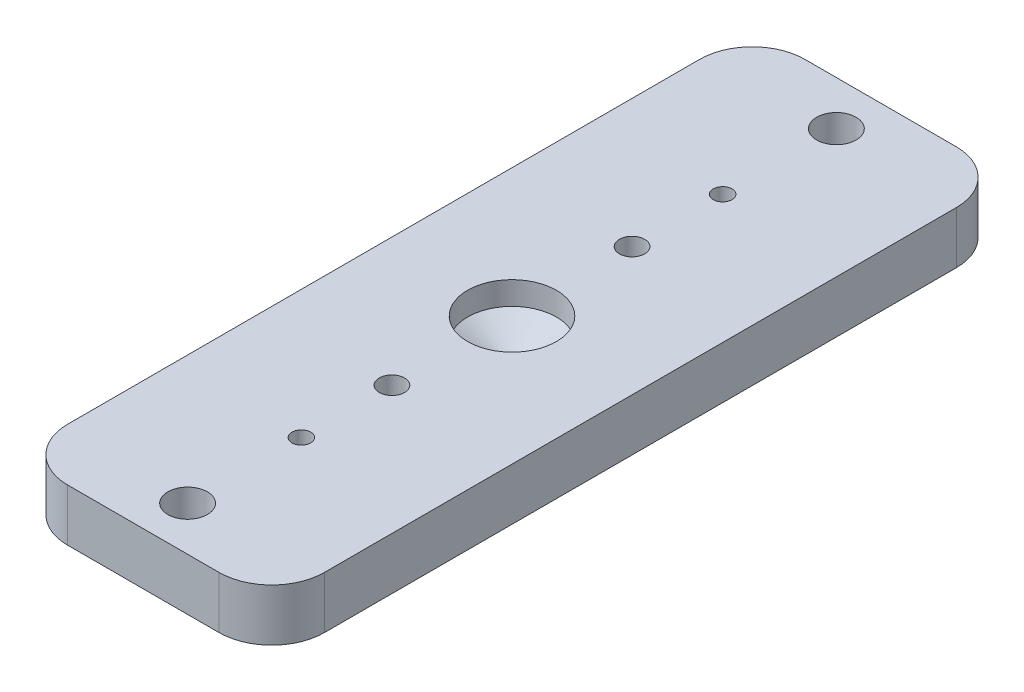
ISO-10303-21;
HEADER;
FILE_DESCRIPTION(('STEP AP214'),'2;1');
FILE_NAME('part.step','',(''),(''),'','','');
FILE_SCHEMA(('AUTOMOTIVE_DESIGN { 1 0 10303 214 1 1 1 1 }'));
ENDSEC;
DATA;
#1=APPLICATION_CONTEXT('core data for automotive mechanical design processes');
#2=APPLICATION_PROTOCOL_DEFINITION('international standard','automotive_design',2000,#1);
#3=PRODUCT_CONTEXT('',#1,'mechanical');
#4=PRODUCT('Part','Part','',(#3));
#5=PRODUCT_RELATED_PRODUCT_CATEGORY('part','',(#4));
#6=PRODUCT_DEFINITION_FORMATION('','',#4);
#7=PRODUCT_DEFINITION_CONTEXT('part definition',#1,'design');
#8=PRODUCT_DEFINITION('design','',#6,#7);
#9=PRODUCT_DEFINITION_SHAPE('','',#8);
#10=(LENGTH_UNIT() NAMED_UNIT(*) SI_UNIT(.MILLI.,.METRE.));
#11=(NAMED_UNIT(*) PLANE_ANGLE_UNIT() SI_UNIT($,.RADIAN.));
#12=(NAMED_UNIT(*) SI_UNIT($,.STERADIAN.) SOLID_ANGLE_UNIT());
#13=UNCERTAINTY_MEASURE_WITH_UNIT(LENGTH_MEASURE(1.E-05),#10,'distance_accuracy_value','');
#14=(GEOMETRIC_REPRESENTATION_CONTEXT(3) GLOBAL_UNCERTAINTY_ASSIGNED_CONTEXT((#13)) GLOBAL_UNIT_ASSIGNED_CONTEXT((#10,
#11,#12)) REPRESENTATION_CONTEXT('',''));
#15=CARTESIAN_POINT('',(0.,0.,0.));
#16=DIRECTION('',(0.,0.,1.));
#17=DIRECTION('',(1.,0.,0.));
#18=AXIS2_PLACEMENT_3D('',#15,#16,#17);
#19=CARTESIAN_POINT('',(0.,4.7625,-14.478));
#20=DIRECTION('',(0.,-1.,0.));
#21=DIRECTION('',(0.,0.,-1.));
#22=AXIS2_PLACEMENT_3D('',#19,#20,#21);
#23=CYLINDRICAL_SURFACE('',#22,1.524);
#24=CARTESIAN_POINT('',(0.,4.7625,-14.478));
#25=DIRECTION('',(0.,-1.,0.));
#26=DIRECTION('',(0.,0.,1.));
#27=AXIS2_PLACEMENT_3D('',#24,#25,#26);
#28=CIRCLE('',#27,1.524);
#29=CARTESIAN_POINT('',(0.,4.7625,-12.954));
#30=VERTEX_POINT('',#29);
#31=EDGE_CURVE('E178',#30,#30,#28,.T.);
#32=ORIENTED_EDGE('',*,*,#31,.F.);
#33=EDGE_LOOP('',(#32));
#34=FACE_BOUND('',#33,.T.);
#35=CARTESIAN_POINT('',(0.,1.778,-14.478));
#36=DIRECTION('',(0.,-1.,0.));
#37=DIRECTION('',(0.,0.,-1.));
#38=AXIS2_PLACEMENT_3D('',#35,#36,#37);
#39=CIRCLE('',#38,1.524);
#40=CARTESIAN_POINT('',(0.,1.778,-16.002));
#41=VERTEX_POINT('',#40);
#42=EDGE_CURVE('E126',#41,#41,#39,.F.);
#43=ORIENTED_EDGE('',*,*,#42,.F.);
#44=EDGE_LOOP('',(#43));
#45=FACE_BOUND('',#44,.T.);
#46=ADVANCED_FACE('F35',(#34,#45),#23,.F.);
#47=CARTESIAN_POINT('',(-15.478125,4.7625,-44.45));
#48=DIRECTION('',(0.,0.,1.));
#49=DIRECTION('',(1.,0.,0.));
#50=AXIS2_PLACEMENT_3D('',#47,#48,#49);
#51=PLANE('',#50);
#52=DIRECTION('',(-1.,0.,0.));
#53=VECTOR('',#52,1.);
#54=CARTESIAN_POINT('',(-15.478125,4.7625,-44.45));
#55=LINE('',#54,#53);
#56=CARTESIAN_POINT('',(9.128125,4.7625,-44.45));
#57=VERTEX_POINT('',#56);
#58=CARTESIAN_POINT('',(-9.128125,4.7625,-44.45));
#59=VERTEX_POINT('',#58);
#60=EDGE_CURVE('E184',#57,#59,#55,.T.);
#61=ORIENTED_EDGE('',*,*,#60,.F.);
#62=DIRECTION('',(0.,-1.,0.));
#63=VECTOR('',#62,1.);
#64=CARTESIAN_POINT('',(9.128125,4.7625,-44.45));
#65=LINE('',#64,#63);
#66=CARTESIAN_POINT('',(9.128125,-1.524,-44.45));
#67=VERTEX_POINT('',#66);
#68=EDGE_CURVE('E196',#57,#67,#65,.T.);
#69=ORIENTED_EDGE('',*,*,#68,.T.);
#70=DIRECTION('',(1.,0.,0.));
#71=VECTOR('',#70,1.);
#72=CARTESIAN_POINT('',(9.128125,-1.524,-44.45));
#73=LINE('',#72,#71);
#74=CARTESIAN_POINT('',(-9.128125,-1.524,-44.45));
#75=VERTEX_POINT('',#74);
#76=EDGE_CURVE('E163',#75,#67,#73,.T.);
#77=ORIENTED_EDGE('',*,*,#76,.F.);
#78=DIRECTION('',(0.,-1.,0.));
#79=VECTOR('',#78,1.);
#80=CARTESIAN_POINT('',(-9.128125,4.7625,-44.45));
#81=LINE('',#80,#79);
#82=EDGE_CURVE('E194',#75,#59,#81,.F.);
#83=ORIENTED_EDGE('',*,*,#82,.T.);
#84=EDGE_LOOP('',(#61,#69,#77,#83));
#85=FACE_BOUND('',#84,.T.);
#86=ADVANCED_FACE('F219',(#85),#51,.F.);
#87=CARTESIAN_POINT('',(-15.478125,4.7625,44.45));
#88=DIRECTION('',(1.,0.,0.));
#89=DIRECTION('',(0.,0.,-1.));
#90=AXIS2_PLACEMENT_3D('',#87,#88,#89);
#91=PLANE('',#90);
#92=DIRECTION('',(0.,0.,1.));
#93=VECTOR('',#92,1.);
#94=CARTESIAN_POINT('',(-15.478125,4.7625,44.45));
#95=LINE('',#94,#93);
#96=CARTESIAN_POINT('',(-15.478125,4.7625,-38.1));
#97=VERTEX_POINT('',#96);
#98=CARTESIAN_POINT('',(-15.478125,4.7625,38.1));
#99=VERTEX_POINT('',#98);
#100=EDGE_CURVE('E187',#97,#99,#95,.T.);
#101=ORIENTED_EDGE('',*,*,#100,.F.);
#102=DIRECTION('',(0.,-1.,0.));
#103=VECTOR('',#102,1.);
#104=CARTESIAN_POINT('',(-15.478125,4.7625,-38.1));
#105=LINE('',#104,#103);
#106=CARTESIAN_POINT('',(-15.478125,-1.524,-38.1));
#107=VERTEX_POINT('',#106);
#108=EDGE_CURVE('E211',#97,#107,#105,.T.);
#109=ORIENTED_EDGE('',*,*,#108,.T.);
#110=DIRECTION('',(0.,0.,-1.));
#111=VECTOR('',#110,1.);
#112=CARTESIAN_POINT('',(-15.478125,-1.524,-38.1));
#113=LINE('',#112,#111);
#114=CARTESIAN_POINT('',(-15.478125,-1.524,38.1));
#115=VERTEX_POINT('',#114);
#116=EDGE_CURVE('E157',#115,#107,#113,.T.);
#117=ORIENTED_EDGE('',*,*,#116,.F.);
#118=DIRECTION('',(0.,-1.,0.));
#119=VECTOR('',#118,1.);
#120=CARTESIAN_POINT('',(-15.478125,4.7625,38.1));
#121=LINE('',#120,#119);
#122=EDGE_CURVE('E209',#115,#99,#121,.F.);
#123=ORIENTED_EDGE('',*,*,#122,.T.);
#124=EDGE_LOOP('',(#101,#109,#117,#123));
#125=FACE_BOUND('',#124,.T.);
#126=ADVANCED_FACE('F225',(#125),#91,.F.);
#127=CARTESIAN_POINT('',(-15.478125,4.7625,44.45));
#128=DIRECTION('',(0.,0.,-1.));
#129=DIRECTION('',(-1.,0.,0.));
#130=AXIS2_PLACEMENT_3D('',#127,#128,#129);
#131=PLANE('',#130);
#132=DIRECTION('',(0.,-1.,0.));
#133=VECTOR('',#132,1.);
#134=CARTESIAN_POINT('',(-9.128125,4.7625,44.45));
#135=LINE('',#134,#133);
#136=CARTESIAN_POINT('',(-9.128125,4.7625,44.45));
#137=VERTEX_POINT('',#136);
#138=CARTESIAN_POINT('',(-9.128125,-1.524,44.45));
#139=VERTEX_POINT('',#138);
#140=EDGE_CURVE('E44',#137,#139,#135,.T.);
#141=ORIENTED_EDGE('',*,*,#140,.T.);
#142=DIRECTION('',(-1.,0.,0.));
#143=VECTOR('',#142,1.);
#144=CARTESIAN_POINT('',(-9.128125,-1.524,44.45));
#145=LINE('',#144,#143);
#146=CARTESIAN_POINT('',(9.128125,-1.524,44.45));
#147=VERTEX_POINT('',#146);
#148=EDGE_CURVE('E151',#147,#139,#145,.T.);
#149=ORIENTED_EDGE('',*,*,#148,.F.);
#150=DIRECTION('',(0.,-1.,0.));
#151=VECTOR('',#150,1.);
#152=CARTESIAN_POINT('',(9.128125,4.7625,44.45));
#153=LINE('',#152,#151);
#154=CARTESIAN_POINT('',(9.128125,4.7625,44.45));
#155=VERTEX_POINT('',#154);
#156=EDGE_CURVE('E11',#147,#155,#153,.F.);
#157=ORIENTED_EDGE('',*,*,#156,.T.);
#158=DIRECTION('',(1.,0.,0.));
#159=VECTOR('',#158,1.);
#160=CARTESIAN_POINT('',(-15.478125,4.7625,44.45));
#161=LINE('',#160,#159);
#162=EDGE_CURVE('E189',#137,#155,#161,.T.);
#163=ORIENTED_EDGE('',*,*,#162,.F.);
#164=EDGE_LOOP('',(#141,#149,#157,#163));
#165=FACE_BOUND('',#164,.T.);
#166=ADVANCED_FACE('F245',(#165),#131,.F.);
#167=CARTESIAN_POINT('',(15.478125,4.7625,-44.45));
#168=DIRECTION('',(-1.,0.,0.));
#169=DIRECTION('',(0.,0.,1.));
#170=AXIS2_PLACEMENT_3D('',#167,#168,#169);
#171=PLANE('',#170);
#172=DIRECTION('',(0.,-1.,0.));
#173=VECTOR('',#172,1.);
#174=CARTESIAN_POINT('',(15.478125,4.7625,38.1));
#175=LINE('',#174,#173);
#176=CARTESIAN_POINT('',(15.478125,4.7625,38.1));
#177=VERTEX_POINT('',#176);
#178=CARTESIAN_POINT('',(15.478125,-1.524,38.1));
#179=VERTEX_POINT('',#178);
#180=EDGE_CURVE('E198',#177,#179,#175,.T.);
#181=ORIENTED_EDGE('',*,*,#180,.T.);
#182=DIRECTION('',(0.,0.,1.));
#183=VECTOR('',#182,1.);
#184=CARTESIAN_POINT('',(15.478125,-1.524,38.1));
#185=LINE('',#184,#183);
#186=CARTESIAN_POINT('',(15.478125,-1.524,-38.1));
#187=VERTEX_POINT('',#186);
#188=EDGE_CURVE('E145',#187,#179,#185,.T.);
#189=ORIENTED_EDGE('',*,*,#188,.F.);
#190=DIRECTION('',(0.,-1.,0.));
#191=VECTOR('',#190,1.);
#192=CARTESIAN_POINT('',(15.478125,4.7625,-38.1));
#193=LINE('',#192,#191);
#194=CARTESIAN_POINT('',(15.478125,4.7625,-38.1));
#195=VERTEX_POINT('',#194);
#196=EDGE_CURVE('E200',#187,#195,#193,.F.);
#197=ORIENTED_EDGE('',*,*,#196,.T.);
#198=DIRECTION('',(0.,0.,-1.));
#199=VECTOR('',#198,1.);
#200=CARTESIAN_POINT('',(15.478125,4.7625,-44.45));
#201=LINE('',#200,#199);
#202=EDGE_CURVE('E191',#177,#195,#201,.T.);
#203=ORIENTED_EDGE('',*,*,#202,.F.);
#204=EDGE_LOOP('',(#181,#189,#197,#203));
#205=FACE_BOUND('',#204,.T.);
#206=ADVANCED_FACE('F241',(#205),#171,.F.);
#207=CARTESIAN_POINT('',(15.478125,4.7625,-44.45));
#208=DIRECTION('',(0.,-1.,0.));
#209=DIRECTION('',(0.,0.,-1.));
#210=AXIS2_PLACEMENT_3D('',#207,#208,#209);
#211=PLANE('',#210);
#212=CARTESIAN_POINT('',(0.,4.7625,0.));
#213=DIRECTION('',(0.,1.,0.));
#214=DIRECTION('',(0.,0.,1.));
#215=AXIS2_PLACEMENT_3D('',#212,#213,#214);
#216=CIRCLE('',#215,5.35812999999999);
#217=CARTESIAN_POINT('',(0.,4.7625,5.35812999999999));
#218=VERTEX_POINT('',#217);
#219=EDGE_CURVE('E113',#218,#218,#216,.T.);
#220=ORIENTED_EDGE('',*,*,#219,.F.);
#221=EDGE_LOOP('',(#220));
#222=FACE_BOUND('',#221,.T.);
#223=CARTESIAN_POINT('',(0.,4.7625,25.4));
#224=DIRECTION('',(0.,1.,0.));
#225=DIRECTION('',(0.,0.,1.));
#226=AXIS2_PLACEMENT_3D('',#223,#224,#225);
#227=CIRCLE('',#226,1.1303);
#228=CARTESIAN_POINT('',(0.,4.7625,26.5303));
#229=VERTEX_POINT('',#228);
#230=EDGE_CURVE('E130',#229,#229,#227,.T.);
#231=ORIENTED_EDGE('',*,*,#230,.F.);
#232=EDGE_LOOP('',(#231));
#233=FACE_BOUND('',#232,.T.);
#234=CARTESIAN_POINT('',(0.,4.7625,-25.4));
#235=DIRECTION('',(0.,1.,0.));
#236=DIRECTION('',(0.,0.,1.));
#237=AXIS2_PLACEMENT_3D('',#234,#235,#236);
#238=CIRCLE('',#237,1.1303);
#239=CARTESIAN_POINT('',(0.,4.7625,-24.2697));
#240=VERTEX_POINT('',#239);
#241=EDGE_CURVE('E136',#240,#240,#238,.T.);
#242=ORIENTED_EDGE('',*,*,#241,.F.);
#243=EDGE_LOOP('',(#242));
#244=FACE_BOUND('',#243,.T.);
#245=CARTESIAN_POINT('',(0.,4.7625,39.116));
#246=DIRECTION('',(0.,-1.,0.));
#247=DIRECTION('',(0.,0.,1.));
#248=AXIS2_PLACEMENT_3D('',#245,#246,#247);
#249=CIRCLE('',#248,2.38125);
#250=CARTESIAN_POINT('',(0.,4.7625,41.49725));
#251=VERTEX_POINT('',#250);
#252=EDGE_CURVE('E172',#251,#251,#249,.T.);
#253=ORIENTED_EDGE('',*,*,#252,.T.);
#254=EDGE_LOOP('',(#253));
#255=FACE_BOUND('',#254,.T.);
#256=CARTESIAN_POINT('',(0.,4.7625,-39.116));
#257=DIRECTION('',(0.,-1.,0.));
#258=DIRECTION('',(0.,0.,-1.));
#259=AXIS2_PLACEMENT_3D('',#256,#257,#258);
#260=CIRCLE('',#259,2.38125);
#261=CARTESIAN_POINT('',(0.,4.7625,-41.49725));
#262=VERTEX_POINT('',#261);
#263=EDGE_CURVE('E175',#262,#262,#260,.T.);
#264=ORIENTED_EDGE('',*,*,#263,.T.);
#265=EDGE_LOOP('',(#264));
#266=FACE_BOUND('',#265,.T.);
#267=ORIENTED_EDGE('',*,*,#31,.T.);
#268=EDGE_LOOP('',(#267));
#269=FACE_BOUND('',#268,.T.);
#270=CARTESIAN_POINT('',(0.,4.7625,14.478));
#271=DIRECTION('',(0.,-1.,0.));
#272=DIRECTION('',(0.,0.,-1.));
#273=AXIS2_PLACEMENT_3D('',#270,#271,#272);
#274=CIRCLE('',#273,1.524);
#275=CARTESIAN_POINT('',(0.,4.7625,12.954));
#276=VERTEX_POINT('',#275);
#277=EDGE_CURVE('E181',#276,#276,#274,.T.);
#278=ORIENTED_EDGE('',*,*,#277,.T.);
#279=EDGE_LOOP('',(#278));
#280=FACE_BOUND('',#279,.T.);
#281=ORIENTED_EDGE('',*,*,#202,.T.);
#282=CARTESIAN_POINT('',(9.128125,4.7625,-38.1));
#283=DIRECTION('',(0.,-1.,0.));
#284=DIRECTION('',(0.,0.,-1.));
#285=AXIS2_PLACEMENT_3D('',#282,#283,#284);
#286=CIRCLE('',#285,6.35);
#287=EDGE_CURVE('E207',#195,#57,#286,.F.);
#288=ORIENTED_EDGE('',*,*,#287,.T.);
#289=ORIENTED_EDGE('',*,*,#60,.T.);
#290=CARTESIAN_POINT('',(-9.128125,4.7625,-38.1));
#291=DIRECTION('',(0.,-1.,0.));
#292=DIRECTION('',(0.,0.,-1.));
#293=AXIS2_PLACEMENT_3D('',#290,#291,#292);
#294=CIRCLE('',#293,6.35);
#295=EDGE_CURVE('E205',#59,#97,#294,.F.);
#296=ORIENTED_EDGE('',*,*,#295,.T.);
#297=ORIENTED_EDGE('',*,*,#100,.T.);
#298=CARTESIAN_POINT('',(-9.128125,4.7625,38.1));
#299=DIRECTION('',(0.,-1.,0.));
#300=DIRECTION('',(0.,0.,-1.));
#301=AXIS2_PLACEMENT_3D('',#298,#299,#300);
#302=CIRCLE('',#301,6.35);
#303=EDGE_CURVE('E57',#99,#137,#302,.F.);
#304=ORIENTED_EDGE('',*,*,#303,.T.);
#305=ORIENTED_EDGE('',*,*,#162,.T.);
#306=CARTESIAN_POINT('',(9.128125,4.7625,38.1));
#307=DIRECTION('',(0.,-1.,0.));
#308=DIRECTION('',(0.,0.,-1.));
#309=AXIS2_PLACEMENT_3D('',#306,#307,#308);
#310=CIRCLE('',#309,6.35);
#311=EDGE_CURVE('E203',#155,#177,#310,.F.);
#312=ORIENTED_EDGE('',*,*,#311,.T.);
#313=EDGE_LOOP('',(#281,#288,#289,#296,#297,#304,#305,#312));
#314=FACE_BOUND('',#313,.T.);
#315=ADVANCED_FACE('F237',(#222,#233,#244,#255,#266,#269,#280,#314),#211,.F.);
#316=CARTESIAN_POINT('',(9.128125,4.7625,-38.1));
#317=DIRECTION('',(0.,-1.,0.));
#318=DIRECTION('',(0.,0.,-1.));
#319=AXIS2_PLACEMENT_3D('',#316,#317,#318);
#320=CYLINDRICAL_SURFACE('',#319,6.35);
#321=ORIENTED_EDGE('',*,*,#287,.F.);
#322=ORIENTED_EDGE('',*,*,#196,.F.);
#323=CARTESIAN_POINT('',(9.128125,-1.524,-38.1));
#324=DIRECTION('',(0.,-1.,0.));
#325=DIRECTION('',(0.,0.,-1.));
#326=AXIS2_PLACEMENT_3D('',#323,#324,#325);
#327=CIRCLE('',#326,6.35);
#328=EDGE_CURVE('E142',#67,#187,#327,.T.);
#329=ORIENTED_EDGE('',*,*,#328,.F.);
#330=ORIENTED_EDGE('',*,*,#68,.F.);
#331=EDGE_LOOP('',(#321,#322,#329,#330));
#332=FACE_BOUND('',#331,.T.);
#333=ADVANCED_FACE('F240',(#332),#320,.T.);
#334=CARTESIAN_POINT('',(-9.128125,4.7625,-38.1));
#335=DIRECTION('',(0.,-1.,0.));
#336=DIRECTION('',(0.,0.,-1.));
#337=AXIS2_PLACEMENT_3D('',#334,#335,#336);
#338=CYLINDRICAL_SURFACE('',#337,6.35);
#339=ORIENTED_EDGE('',*,*,#295,.F.);
#340=ORIENTED_EDGE('',*,*,#82,.F.);
#341=CARTESIAN_POINT('',(-9.128125,-1.524,-38.1));
#342=DIRECTION('',(0.,-1.,0.));
#343=DIRECTION('',(0.,0.,-1.));
#344=AXIS2_PLACEMENT_3D('',#341,#342,#343);
#345=CIRCLE('',#344,6.35000000000001);
#346=EDGE_CURVE('E160',#107,#75,#345,.T.);
#347=ORIENTED_EDGE('',*,*,#346,.F.);
#348=ORIENTED_EDGE('',*,*,#108,.F.);
#349=EDGE_LOOP('',(#339,#340,#347,#348));
#350=FACE_BOUND('',#349,.T.);
#351=ADVANCED_FACE('F254',(#350),#338,.T.);
#352=CARTESIAN_POINT('',(9.128125,4.7625,38.1));
#353=DIRECTION('',(0.,-1.,0.));
#354=DIRECTION('',(0.,0.,-1.));
#355=AXIS2_PLACEMENT_3D('',#352,#353,#354);
#356=CYLINDRICAL_SURFACE('',#355,6.35);
#357=ORIENTED_EDGE('',*,*,#311,.F.);
#358=ORIENTED_EDGE('',*,*,#156,.F.);
#359=CARTESIAN_POINT('',(9.128125,-1.524,38.1));
#360=DIRECTION('',(0.,-1.,0.));
#361=DIRECTION('',(0.,0.,-1.));
#362=AXIS2_PLACEMENT_3D('',#359,#360,#361);
#363=CIRCLE('',#362,6.35000000000001);
#364=EDGE_CURVE('E148',#179,#147,#363,.T.);
#365=ORIENTED_EDGE('',*,*,#364,.F.);
#366=ORIENTED_EDGE('',*,*,#180,.F.);
#367=EDGE_LOOP('',(#357,#358,#365,#366));
#368=FACE_BOUND('',#367,.T.);
#369=ADVANCED_FACE('F257',(#368),#356,.T.);
#370=CARTESIAN_POINT('',(-9.128125,4.7625,38.1));
#371=DIRECTION('',(0.,-1.,0.));
#372=DIRECTION('',(0.,0.,-1.));
#373=AXIS2_PLACEMENT_3D('',#370,#371,#372);
#374=CYLINDRICAL_SURFACE('',#373,6.35);
#375=ORIENTED_EDGE('',*,*,#303,.F.);
#376=ORIENTED_EDGE('',*,*,#122,.F.);
#377=CARTESIAN_POINT('',(-9.128125,-1.524,38.1));
#378=DIRECTION('',(0.,-1.,0.));
#379=DIRECTION('',(0.,0.,-1.));
#380=AXIS2_PLACEMENT_3D('',#377,#378,#379);
#381=CIRCLE('',#380,6.35);
#382=EDGE_CURVE('E154',#139,#115,#381,.T.);
#383=ORIENTED_EDGE('',*,*,#382,.F.);
#384=ORIENTED_EDGE('',*,*,#140,.F.);
#385=EDGE_LOOP('',(#375,#376,#383,#384));
#386=FACE_BOUND('',#385,.T.);
#387=ADVANCED_FACE('F37',(#386),#374,.T.);
#388=CARTESIAN_POINT('',(0.,4.7625,14.478));
#389=DIRECTION('',(0.,-1.,0.));
#390=DIRECTION('',(0.,0.,-1.));
#391=AXIS2_PLACEMENT_3D('',#388,#389,#390);
#392=CYLINDRICAL_SURFACE('',#391,1.524);
#393=CARTESIAN_POINT('',(0.,1.778,14.478));
#394=DIRECTION('',(0.,1.,0.));
#395=DIRECTION('',(0.,0.,1.));
#396=AXIS2_PLACEMENT_3D('',#393,#394,#395);
#397=CIRCLE('',#396,1.524);
#398=CARTESIAN_POINT('',(0.,1.778,16.002));
#399=VERTEX_POINT('',#398);
#400=EDGE_CURVE('E39',#399,#399,#397,.F.);
#401=ORIENTED_EDGE('',*,*,#400,.T.);
#402=EDGE_LOOP('',(#401));
#403=FACE_BOUND('',#402,.T.);
#404=ORIENTED_EDGE('',*,*,#277,.F.);
#405=EDGE_LOOP('',(#404));
#406=FACE_BOUND('',#405,.T.);
#407=ADVANCED_FACE('F233',(#403,#406),#392,.F.);
#408=CARTESIAN_POINT('',(0.,4.7625,-39.116));
#409=DIRECTION('',(0.,-1.,0.));
#410=DIRECTION('',(0.,0.,-1.));
#411=AXIS2_PLACEMENT_3D('',#408,#409,#410);
#412=CYLINDRICAL_SURFACE('',#411,2.38125);
#413=ORIENTED_EDGE('',*,*,#263,.F.);
#414=EDGE_LOOP('',(#413));
#415=FACE_BOUND('',#414,.T.);
#416=CARTESIAN_POINT('',(0.,0.,-39.116));
#417=DIRECTION('',(0.,-1.,0.));
#418=DIRECTION('',(0.,0.,-1.));
#419=AXIS2_PLACEMENT_3D('',#416,#417,#418);
#420=CIRCLE('',#419,2.38125);
#421=CARTESIAN_POINT('',(0.,0.,-41.49725));
#422=VERTEX_POINT('',#421);
#423=EDGE_CURVE('E169',#422,#422,#420,.F.);
#424=ORIENTED_EDGE('',*,*,#423,.F.);
#425=EDGE_LOOP('',(#424));
#426=FACE_BOUND('',#425,.T.);
#427=ADVANCED_FACE('F231',(#415,#426),#412,.F.);
#428=CARTESIAN_POINT('',(0.,4.7625,39.116));
#429=DIRECTION('',(0.,-1.,0.));
#430=DIRECTION('',(0.,0.,-1.));
#431=AXIS2_PLACEMENT_3D('',#428,#429,#430);
#432=CYLINDRICAL_SURFACE('',#431,2.38125);
#433=ORIENTED_EDGE('',*,*,#252,.F.);
#434=EDGE_LOOP('',(#433));
#435=FACE_BOUND('',#434,.T.);
#436=CARTESIAN_POINT('',(0.,0.,39.116));
#437=DIRECTION('',(0.,-1.,0.));
#438=DIRECTION('',(0.,0.,-1.));
#439=AXIS2_PLACEMENT_3D('',#436,#437,#438);
#440=CIRCLE('',#439,2.38125);
#441=CARTESIAN_POINT('',(0.,0.,36.73475));
#442=VERTEX_POINT('',#441);
#443=EDGE_CURVE('E166',#442,#442,#440,.F.);
#444=ORIENTED_EDGE('',*,*,#443,.F.);
#445=EDGE_LOOP('',(#444));
#446=FACE_BOUND('',#445,.T.);
#447=ADVANCED_FACE('F302',(#435,#446),#432,.F.);
#448=CARTESIAN_POINT('',(9.128125,0.,-38.1));
#449=DIRECTION('',(0.,-1.,0.));
#450=DIRECTION('',(0.,0.,-1.));
#451=AXIS2_PLACEMENT_3D('',#448,#449,#450);
#452=PLANE('',#451);
#453=ORIENTED_EDGE('',*,*,#443,.T.);
#454=EDGE_LOOP('',(#453));
#455=FACE_BOUND('',#454,.T.);
#456=ADVANCED_FACE('F296',(#455),#452,.F.);
#457=ORIENTED_EDGE('',*,*,#423,.T.);
#458=EDGE_LOOP('',(#457));
#459=FACE_BOUND('',#458,.T.);
#460=ADVANCED_FACE('F286',(#459),#452,.F.);
#461=CARTESIAN_POINT('',(9.128125,-1.524,-38.1));
#462=DIRECTION('',(0.,-1.,0.));
#463=DIRECTION('',(0.,0.,-1.));
#464=AXIS2_PLACEMENT_3D('',#461,#462,#463);
#465=PLANE('',#464);
#466=CARTESIAN_POINT('',(0.,-1.524,14.478));
#467=DIRECTION('',(0.,-1.,0.));
#468=DIRECTION('',(0.,0.,1.));
#469=AXIS2_PLACEMENT_3D('',#466,#467,#468);
#470=CIRCLE('',#469,3.175);
#471=CARTESIAN_POINT('',(0.,-1.524,17.653));
#472=VERTEX_POINT('',#471);
#473=EDGE_CURVE('E112',#472,#472,#470,.T.);
#474=ORIENTED_EDGE('',*,*,#473,.F.);
#475=EDGE_LOOP('',(#474));
#476=FACE_BOUND('',#475,.T.);
#477=CARTESIAN_POINT('',(0.,-1.524,-14.478));
#478=DIRECTION('',(0.,-1.,0.));
#479=DIRECTION('',(0.,0.,-1.));
#480=AXIS2_PLACEMENT_3D('',#477,#478,#479);
#481=CIRCLE('',#480,3.175);
#482=CARTESIAN_POINT('',(0.,-1.524,-17.653));
#483=VERTEX_POINT('',#482);
#484=EDGE_CURVE('E127',#483,#483,#481,.T.);
#485=ORIENTED_EDGE('',*,*,#484,.F.);
#486=EDGE_LOOP('',(#485));
#487=FACE_BOUND('',#486,.T.);
#488=CARTESIAN_POINT('',(0.,-1.524,25.4));
#489=DIRECTION('',(0.,1.,0.));
#490=DIRECTION('',(0.,0.,1.));
#491=AXIS2_PLACEMENT_3D('',#488,#489,#490);
#492=CIRCLE('',#491,1.1303);
#493=CARTESIAN_POINT('',(0.,-1.524,26.5303));
#494=VERTEX_POINT('',#493);
#495=EDGE_CURVE('E133',#494,#494,#492,.T.);
#496=ORIENTED_EDGE('',*,*,#495,.T.);
#497=EDGE_LOOP('',(#496));
#498=FACE_BOUND('',#497,.T.);
#499=CARTESIAN_POINT('',(0.,-1.524,-25.4));
#500=DIRECTION('',(0.,1.,0.));
#501=DIRECTION('',(0.,0.,1.));
#502=AXIS2_PLACEMENT_3D('',#499,#500,#501);
#503=CIRCLE('',#502,1.1303);
#504=CARTESIAN_POINT('',(0.,-1.524,-24.2697));
#505=VERTEX_POINT('',#504);
#506=EDGE_CURVE('E139',#505,#505,#503,.T.);
#507=ORIENTED_EDGE('',*,*,#506,.T.);
#508=EDGE_LOOP('',(#507));
#509=FACE_BOUND('',#508,.T.);
#510=ORIENTED_EDGE('',*,*,#328,.T.);
#511=ORIENTED_EDGE('',*,*,#188,.T.);
#512=ORIENTED_EDGE('',*,*,#364,.T.);
#513=ORIENTED_EDGE('',*,*,#148,.T.);
#514=ORIENTED_EDGE('',*,*,#382,.T.);
#515=ORIENTED_EDGE('',*,*,#116,.T.);
#516=ORIENTED_EDGE('',*,*,#346,.T.);
#517=ORIENTED_EDGE('',*,*,#76,.T.);
#518=EDGE_LOOP('',(#510,#511,#512,#513,#514,#515,#516,#517));
#519=FACE_BOUND('',#518,.T.);
#520=ADVANCED_FACE('F279',(#476,#487,#498,#509,#519),#465,.T.);
#521=CARTESIAN_POINT('',(0.,4.7625,-25.4));
#522=DIRECTION('',(0.,1.,0.));
#523=DIRECTION('',(0.,0.,1.));
#524=AXIS2_PLACEMENT_3D('',#521,#522,#523);
#525=CYLINDRICAL_SURFACE('',#524,1.1303);
#526=ORIENTED_EDGE('',*,*,#506,.F.);
#527=EDGE_LOOP('',(#526));
#528=FACE_BOUND('',#527,.T.);
#529=ORIENTED_EDGE('',*,*,#241,.T.);
#530=EDGE_LOOP('',(#529));
#531=FACE_BOUND('',#530,.T.);
#532=ADVANCED_FACE('F285',(#528,#531),#525,.F.);
#533=CARTESIAN_POINT('',(0.,4.7625,25.4));
#534=DIRECTION('',(0.,1.,0.));
#535=DIRECTION('',(0.,0.,1.));
#536=AXIS2_PLACEMENT_3D('',#533,#534,#535);
#537=CYLINDRICAL_SURFACE('',#536,1.1303);
#538=ORIENTED_EDGE('',*,*,#495,.F.);
#539=EDGE_LOOP('',(#538));
#540=FACE_BOUND('',#539,.T.);
#541=ORIENTED_EDGE('',*,*,#230,.T.);
#542=EDGE_LOOP('',(#541));
#543=FACE_BOUND('',#542,.T.);
#544=ADVANCED_FACE('F293',(#540,#543),#537,.F.);
#545=CARTESIAN_POINT('',(0.,1.778,-14.478));
#546=DIRECTION('',(0.,-1.,0.));
#547=DIRECTION('',(0.,0.,-1.));
#548=AXIS2_PLACEMENT_3D('',#545,#546,#547);
#549=PLANE('',#548);
#550=CARTESIAN_POINT('',(0.,1.778,-14.478));
#551=DIRECTION('',(0.,-1.,0.));
#552=DIRECTION('',(0.,0.,-1.));
#553=AXIS2_PLACEMENT_3D('',#550,#551,#552);
#554=CIRCLE('',#553,3.175);
#555=CARTESIAN_POINT('',(0.,1.778,-17.653));
#556=VERTEX_POINT('',#555);
#557=EDGE_CURVE('E123',#556,#556,#554,.T.);
#558=ORIENTED_EDGE('',*,*,#557,.T.);
#559=EDGE_LOOP('',(#558));
#560=FACE_BOUND('',#559,.T.);
#561=ORIENTED_EDGE('',*,*,#42,.T.);
#562=EDGE_LOOP('',(#561));
#563=FACE_BOUND('',#562,.T.);
#564=ADVANCED_FACE('F216',(#560,#563),#549,.T.);
#565=CARTESIAN_POINT('',(0.,1.778,-14.478));
#566=DIRECTION('',(0.,-1.,0.));
#567=DIRECTION('',(0.,0.,-1.));
#568=AXIS2_PLACEMENT_3D('',#565,#566,#567);
#569=CYLINDRICAL_SURFACE('',#568,3.175);
#570=ORIENTED_EDGE('',*,*,#557,.F.);
#571=EDGE_LOOP('',(#570));
#572=FACE_BOUND('',#571,.T.);
#573=ORIENTED_EDGE('',*,*,#484,.T.);
#574=EDGE_LOOP('',(#573));
#575=FACE_BOUND('',#574,.T.);
#576=ADVANCED_FACE('F385',(#572,#575),#569,.F.);
#577=CARTESIAN_POINT('',(0.,1.778,14.478));
#578=DIRECTION('',(0.,1.,0.));
#579=DIRECTION('',(0.,0.,1.));
#580=AXIS2_PLACEMENT_3D('',#577,#578,#579);
#581=PLANE('',#580);
#582=CARTESIAN_POINT('',(0.,1.778,14.478));
#583=DIRECTION('',(0.,-1.,0.));
#584=DIRECTION('',(0.,0.,1.));
#585=AXIS2_PLACEMENT_3D('',#582,#583,#584);
#586=CIRCLE('',#585,3.175);
#587=CARTESIAN_POINT('',(0.,1.778,17.653));
#588=VERTEX_POINT('',#587);
#589=EDGE_CURVE('E116',#588,#588,#586,.T.);
#590=ORIENTED_EDGE('',*,*,#589,.T.);
#591=EDGE_LOOP('',(#590));
#592=FACE_BOUND('',#591,.T.);
#593=ORIENTED_EDGE('',*,*,#400,.F.);
#594=EDGE_LOOP('',(#593));
#595=FACE_BOUND('',#594,.T.);
#596=ADVANCED_FACE('F394',(#592,#595),#581,.F.);
#597=CARTESIAN_POINT('',(0.,1.778,14.478));
#598=DIRECTION('',(0.,-1.,0.));
#599=DIRECTION('',(0.,0.,-1.));
#600=AXIS2_PLACEMENT_3D('',#597,#598,#599);
#601=CYLINDRICAL_SURFACE('',#600,3.175);
#602=ORIENTED_EDGE('',*,*,#589,.F.);
#603=EDGE_LOOP('',(#602));
#604=FACE_BOUND('',#603,.T.);
#605=ORIENTED_EDGE('',*,*,#473,.T.);
#606=EDGE_LOOP('',(#605));
#607=FACE_BOUND('',#606,.T.);
#608=ADVANCED_FACE('F106',(#604,#607),#601,.F.);
#609=CARTESIAN_POINT('',(0.,1.9685,0.));
#610=DIRECTION('',(0.,1.,0.));
#611=DIRECTION('',(0.,0.,1.));
#612=AXIS2_PLACEMENT_3D('',#609,#610,#611);
#613=CONICAL_SURFACE('',#612,5.35813,1.02974425867665);
#614=CARTESIAN_POINT('',(0.,-1.25098930863014,0.));
#615=VERTEX_POINT('',#614);
#616=VERTEX_LOOP('',#615);
#617=FACE_BOUND('',#616,.T.);
#618=CARTESIAN_POINT('',(0.,1.9685,0.));
#619=DIRECTION('',(0.,1.,0.));
#620=DIRECTION('',(0.,0.,1.));
#621=AXIS2_PLACEMENT_3D('',#618,#619,#620);
#622=CIRCLE('',#621,5.35813);
#623=CARTESIAN_POINT('',(0.,1.9685,5.35813));
#624=VERTEX_POINT('',#623);
#625=EDGE_CURVE('E110',#624,#624,#622,.T.);
#626=ORIENTED_EDGE('',*,*,#625,.T.);
#627=EDGE_LOOP('',(#626));
#628=FACE_BOUND('',#627,.T.);
#629=ADVANCED_FACE('F102',(#617,#628),#613,.F.);
#630=CARTESIAN_POINT('',(0.,4.7625,0.));
#631=DIRECTION('',(0.,1.,0.));
#632=DIRECTION('',(0.,0.,1.));
#633=AXIS2_PLACEMENT_3D('',#630,#631,#632);
#634=CYLINDRICAL_SURFACE('',#633,5.35812999999999);
#635=ORIENTED_EDGE('',*,*,#625,.F.);
#636=EDGE_LOOP('',(#635));
#637=FACE_BOUND('',#636,.T.);
#638=ORIENTED_EDGE('',*,*,#219,.T.);
#639=EDGE_LOOP('',(#638));
#640=FACE_BOUND('',#639,.T.);
#641=ADVANCED_FACE('F105',(#637,#640),#634,.F.);
#642=CLOSED_SHELL('',(#46,#86,#126,#166,#206,#315,#333,#351,#369,#387,#407,#427,#447,#456,#460,
#520,#532,#544,#564,#576,#596,#608,#629,#641));
#643=MANIFOLD_SOLID_BREP('B2',#642);
#644=ADVANCED_BREP_SHAPE_REPRESENTATION('',(#18,#643),#14);
#645=SHAPE_DEFINITION_REPRESENTATION(#9,#644);
ENDSEC;
END-ISO-10303-21;
